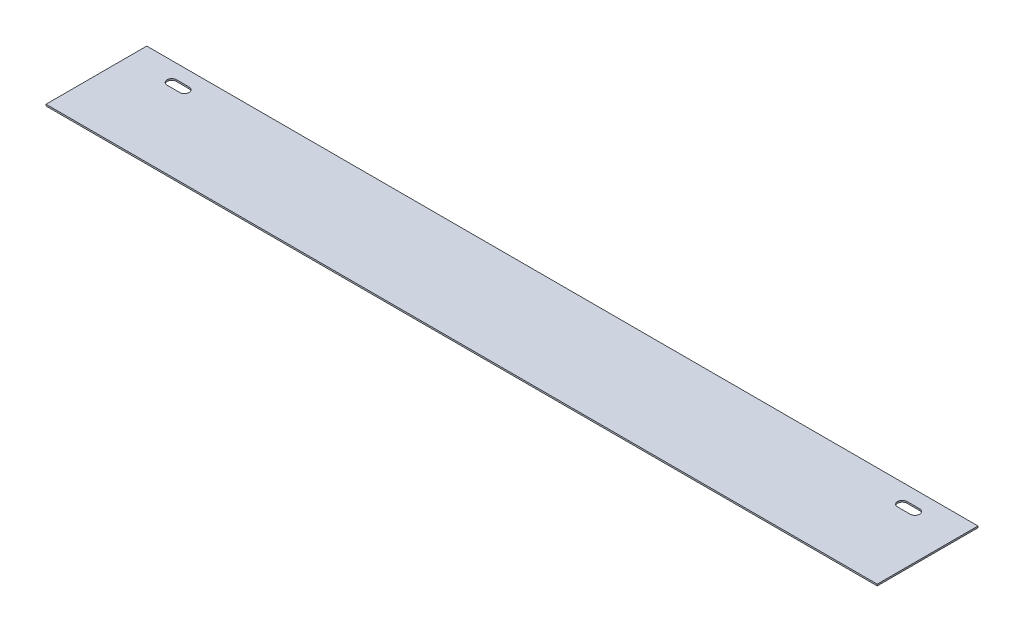
ISO-10303-21;
HEADER;
FILE_DESCRIPTION(('STEP AP214'),'2;1');
FILE_NAME('part.step','',(''),(''),'','','');
FILE_SCHEMA(('AUTOMOTIVE_DESIGN { 1 0 10303 214 1 1 1 1 }'));
ENDSEC;
DATA;
#1=APPLICATION_CONTEXT('core data for automotive mechanical design processes');
#2=APPLICATION_PROTOCOL_DEFINITION('international standard','automotive_design',2000,#1);
#3=PRODUCT_CONTEXT('',#1,'mechanical');
#4=PRODUCT('Part','Part','',(#3));
#5=PRODUCT_RELATED_PRODUCT_CATEGORY('part','',(#4));
#6=PRODUCT_DEFINITION_FORMATION('','',#4);
#7=PRODUCT_DEFINITION_CONTEXT('part definition',#1,'design');
#8=PRODUCT_DEFINITION('design','',#6,#7);
#9=PRODUCT_DEFINITION_SHAPE('','',#8);
#10=(LENGTH_UNIT() NAMED_UNIT(*) SI_UNIT(.MILLI.,.METRE.));
#11=(NAMED_UNIT(*) PLANE_ANGLE_UNIT() SI_UNIT($,.RADIAN.));
#12=(NAMED_UNIT(*) SI_UNIT($,.STERADIAN.) SOLID_ANGLE_UNIT());
#13=UNCERTAINTY_MEASURE_WITH_UNIT(LENGTH_MEASURE(1.E-05),#10,'distance_accuracy_value','');
#14=(GEOMETRIC_REPRESENTATION_CONTEXT(3) GLOBAL_UNCERTAINTY_ASSIGNED_CONTEXT((#13)) GLOBAL_UNIT_ASSIGNED_CONTEXT((#10,
#11,#12)) REPRESENTATION_CONTEXT('',''));
#15=CARTESIAN_POINT('',(0.,0.,0.));
#16=DIRECTION('',(0.,0.,1.));
#17=DIRECTION('',(1.,0.,0.));
#18=AXIS2_PLACEMENT_3D('',#15,#16,#17);
#19=CARTESIAN_POINT('',(0.,1.6002,0.));
#20=DIRECTION('',(1.,0.,0.));
#21=DIRECTION('',(0.,0.,-1.));
#22=AXIS2_PLACEMENT_3D('',#19,#20,#21);
#23=PLANE('',#22);
#24=DIRECTION('',(0.,0.,1.));
#25=VECTOR('',#24,1.);
#26=CARTESIAN_POINT('',(0.,0.,0.));
#27=LINE('',#26,#25);
#28=CARTESIAN_POINT('',(0.,0.,0.));
#29=VERTEX_POINT('',#28);
#30=CARTESIAN_POINT('',(0.,0.,101.6));
#31=VERTEX_POINT('',#30);
#32=EDGE_CURVE('E185',#29,#31,#27,.T.);
#33=ORIENTED_EDGE('',*,*,#32,.T.);
#34=DIRECTION('',(0.,-1.,0.));
#35=VECTOR('',#34,1.);
#36=CARTESIAN_POINT('',(0.,1.6002,101.6));
#37=LINE('',#36,#35);
#38=CARTESIAN_POINT('',(0.,1.6002,101.6));
#39=VERTEX_POINT('',#38);
#40=EDGE_CURVE('E11',#39,#31,#37,.T.);
#41=ORIENTED_EDGE('',*,*,#40,.F.);
#42=DIRECTION('',(0.,0.,1.));
#43=VECTOR('',#42,1.);
#44=CARTESIAN_POINT('',(0.,1.6002,0.));
#45=LINE('',#44,#43);
#46=CARTESIAN_POINT('',(0.,1.6002,0.));
#47=VERTEX_POINT('',#46);
#48=EDGE_CURVE('E192',#47,#39,#45,.T.);
#49=ORIENTED_EDGE('',*,*,#48,.F.);
#50=DIRECTION('',(0.,-1.,0.));
#51=VECTOR('',#50,1.);
#52=CARTESIAN_POINT('',(0.,1.6002,0.));
#53=LINE('',#52,#51);
#54=EDGE_CURVE('E202',#47,#29,#53,.T.);
#55=ORIENTED_EDGE('',*,*,#54,.T.);
#56=EDGE_LOOP('',(#33,#41,#49,#55));
#57=FACE_BOUND('',#56,.T.);
#58=ADVANCED_FACE('F35',(#57),#23,.F.);
#59=CARTESIAN_POINT('',(0.,1.6002,101.6));
#60=DIRECTION('',(0.,0.,-1.));
#61=DIRECTION('',(-1.,0.,0.));
#62=AXIS2_PLACEMENT_3D('',#59,#60,#61);
#63=PLANE('',#62);
#64=DIRECTION('',(1.,0.,0.));
#65=VECTOR('',#64,1.);
#66=CARTESIAN_POINT('',(0.,0.,101.6));
#67=LINE('',#66,#65);
#68=CARTESIAN_POINT('',(838.2,0.,101.6));
#69=VERTEX_POINT('',#68);
#70=EDGE_CURVE('E205',#31,#69,#67,.T.);
#71=ORIENTED_EDGE('',*,*,#70,.T.);
#72=DIRECTION('',(0.,-1.,0.));
#73=VECTOR('',#72,1.);
#74=CARTESIAN_POINT('',(838.2,1.6002,101.6));
#75=LINE('',#74,#73);
#76=CARTESIAN_POINT('',(838.2,1.6002,101.6));
#77=VERTEX_POINT('',#76);
#78=EDGE_CURVE('E42',#77,#69,#75,.T.);
#79=ORIENTED_EDGE('',*,*,#78,.F.);
#80=DIRECTION('',(1.,0.,0.));
#81=VECTOR('',#80,1.);
#82=CARTESIAN_POINT('',(0.,1.6002,101.6));
#83=LINE('',#82,#81);
#84=EDGE_CURVE('E195',#39,#77,#83,.T.);
#85=ORIENTED_EDGE('',*,*,#84,.F.);
#86=ORIENTED_EDGE('',*,*,#40,.T.);
#87=EDGE_LOOP('',(#71,#79,#85,#86));
#88=FACE_BOUND('',#87,.T.);
#89=ADVANCED_FACE('F234',(#88),#63,.F.);
#90=CARTESIAN_POINT('',(838.2,1.6002,0.));
#91=DIRECTION('',(-1.,0.,0.));
#92=DIRECTION('',(0.,0.,1.));
#93=AXIS2_PLACEMENT_3D('',#90,#91,#92);
#94=PLANE('',#93);
#95=DIRECTION('',(0.,0.,-1.));
#96=VECTOR('',#95,1.);
#97=CARTESIAN_POINT('',(838.2,0.,0.));
#98=LINE('',#97,#96);
#99=CARTESIAN_POINT('',(838.2,0.,0.));
#100=VERTEX_POINT('',#99);
#101=EDGE_CURVE('E207',#69,#100,#98,.T.);
#102=ORIENTED_EDGE('',*,*,#101,.T.);
#103=DIRECTION('',(0.,-1.,0.));
#104=VECTOR('',#103,1.);
#105=CARTESIAN_POINT('',(838.2,1.6002,0.));
#106=LINE('',#105,#104);
#107=CARTESIAN_POINT('',(838.2,1.6002,0.));
#108=VERTEX_POINT('',#107);
#109=EDGE_CURVE('E212',#108,#100,#106,.T.);
#110=ORIENTED_EDGE('',*,*,#109,.F.);
#111=DIRECTION('',(0.,0.,-1.));
#112=VECTOR('',#111,1.);
#113=CARTESIAN_POINT('',(838.2,1.6002,0.));
#114=LINE('',#113,#112);
#115=EDGE_CURVE('E198',#77,#108,#114,.T.);
#116=ORIENTED_EDGE('',*,*,#115,.F.);
#117=ORIENTED_EDGE('',*,*,#78,.T.);
#118=EDGE_LOOP('',(#102,#110,#116,#117));
#119=FACE_BOUND('',#118,.T.);
#120=ADVANCED_FACE('F219',(#119),#94,.F.);
#121=CARTESIAN_POINT('',(0.,1.6002,0.));
#122=DIRECTION('',(0.,0.,1.));
#123=DIRECTION('',(1.,0.,0.));
#124=AXIS2_PLACEMENT_3D('',#121,#122,#123);
#125=PLANE('',#124);
#126=DIRECTION('',(-1.,0.,0.));
#127=VECTOR('',#126,1.);
#128=CARTESIAN_POINT('',(0.,0.,0.));
#129=LINE('',#128,#127);
#130=EDGE_CURVE('E196',#100,#29,#129,.T.);
#131=ORIENTED_EDGE('',*,*,#130,.T.);
#132=ORIENTED_EDGE('',*,*,#54,.F.);
#133=DIRECTION('',(-1.,0.,0.));
#134=VECTOR('',#133,1.);
#135=CARTESIAN_POINT('',(0.,1.6002,0.));
#136=LINE('',#135,#134);
#137=EDGE_CURVE('E200',#108,#47,#136,.T.);
#138=ORIENTED_EDGE('',*,*,#137,.F.);
#139=ORIENTED_EDGE('',*,*,#109,.T.);
#140=EDGE_LOOP('',(#131,#132,#138,#139));
#141=FACE_BOUND('',#140,.T.);
#142=ADVANCED_FACE('F227',(#141),#125,.F.);
#143=CARTESIAN_POINT('',(0.,1.6002,0.));
#144=DIRECTION('',(0.,1.,0.));
#145=DIRECTION('',(0.,0.,1.));
#146=AXIS2_PLACEMENT_3D('',#143,#144,#145);
#147=PLANE('',#146);
#148=CARTESIAN_POINT('',(781.05,1.6002,19.177));
#149=DIRECTION('',(0.,1.,0.));
#150=DIRECTION('',(0.,0.,1.));
#151=AXIS2_PLACEMENT_3D('',#148,#149,#150);
#152=CIRCLE('',#151,4.7625);
#153=CARTESIAN_POINT('',(781.05,1.6002,14.4145));
#154=VERTEX_POINT('',#153);
#155=CARTESIAN_POINT('',(781.05,1.6002,23.9395));
#156=VERTEX_POINT('',#155);
#157=EDGE_CURVE('E49',#154,#156,#152,.T.);
#158=ORIENTED_EDGE('',*,*,#157,.F.);
#159=DIRECTION('',(-1.,0.,0.));
#160=VECTOR('',#159,1.);
#161=CARTESIAN_POINT('',(781.05,1.6002,14.4145));
#162=LINE('',#161,#160);
#163=CARTESIAN_POINT('',(793.75,1.6002,14.4145));
#164=VERTEX_POINT('',#163);
#165=EDGE_CURVE('E141',#164,#154,#162,.T.);
#166=ORIENTED_EDGE('',*,*,#165,.F.);
#167=CARTESIAN_POINT('',(793.75,1.6002,19.177));
#168=DIRECTION('',(0.,1.,0.));
#169=DIRECTION('',(0.,0.,1.));
#170=AXIS2_PLACEMENT_3D('',#167,#168,#169);
#171=CIRCLE('',#170,4.7625);
#172=CARTESIAN_POINT('',(793.75,1.6002,23.9395));
#173=VERTEX_POINT('',#172);
#174=EDGE_CURVE('E144',#173,#164,#171,.T.);
#175=ORIENTED_EDGE('',*,*,#174,.F.);
#176=DIRECTION('',(1.,0.,0.));
#177=VECTOR('',#176,1.);
#178=CARTESIAN_POINT('',(781.05,1.6002,23.9395));
#179=LINE('',#178,#177);
#180=EDGE_CURVE('E150',#156,#173,#179,.T.);
#181=ORIENTED_EDGE('',*,*,#180,.F.);
#182=EDGE_LOOP('',(#158,#166,#175,#181));
#183=FACE_BOUND('',#182,.T.);
#184=CARTESIAN_POINT('',(44.45,1.6002,19.177));
#185=DIRECTION('',(0.,1.,0.));
#186=DIRECTION('',(0.,0.,1.));
#187=AXIS2_PLACEMENT_3D('',#184,#185,#186);
#188=CIRCLE('',#187,4.7625);
#189=CARTESIAN_POINT('',(44.45,1.6002,14.4145));
#190=VERTEX_POINT('',#189);
#191=CARTESIAN_POINT('',(44.45,1.6002,23.9395));
#192=VERTEX_POINT('',#191);
#193=EDGE_CURVE('E156',#190,#192,#188,.T.);
#194=ORIENTED_EDGE('',*,*,#193,.F.);
#195=DIRECTION('',(-1.,0.,0.));
#196=VECTOR('',#195,1.);
#197=CARTESIAN_POINT('',(44.45,1.6002,14.4145));
#198=LINE('',#197,#196);
#199=CARTESIAN_POINT('',(57.15,1.6002,14.4145));
#200=VERTEX_POINT('',#199);
#201=EDGE_CURVE('E164',#200,#190,#198,.T.);
#202=ORIENTED_EDGE('',*,*,#201,.F.);
#203=CARTESIAN_POINT('',(57.15,1.6002,19.177));
#204=DIRECTION('',(0.,1.,0.));
#205=DIRECTION('',(0.,0.,1.));
#206=AXIS2_PLACEMENT_3D('',#203,#204,#205);
#207=CIRCLE('',#206,4.7625);
#208=CARTESIAN_POINT('',(57.15,1.6002,23.9395));
#209=VERTEX_POINT('',#208);
#210=EDGE_CURVE('E178',#209,#200,#207,.T.);
#211=ORIENTED_EDGE('',*,*,#210,.F.);
#212=DIRECTION('',(1.,0.,0.));
#213=VECTOR('',#212,1.);
#214=CARTESIAN_POINT('',(44.45,1.6002,23.9395));
#215=LINE('',#214,#213);
#216=EDGE_CURVE('E175',#192,#209,#215,.T.);
#217=ORIENTED_EDGE('',*,*,#216,.F.);
#218=EDGE_LOOP('',(#194,#202,#211,#217));
#219=FACE_BOUND('',#218,.T.);
#220=ORIENTED_EDGE('',*,*,#48,.T.);
#221=ORIENTED_EDGE('',*,*,#84,.T.);
#222=ORIENTED_EDGE('',*,*,#115,.T.);
#223=ORIENTED_EDGE('',*,*,#137,.T.);
#224=EDGE_LOOP('',(#220,#221,#222,#223));
#225=FACE_BOUND('',#224,.T.);
#226=ADVANCED_FACE('F233',(#183,#219,#225),#147,.T.);
#227=CARTESIAN_POINT('',(0.,0.,0.));
#228=DIRECTION('',(0.,1.,0.));
#229=DIRECTION('',(0.,0.,1.));
#230=AXIS2_PLACEMENT_3D('',#227,#228,#229);
#231=PLANE('',#230);
#232=DIRECTION('',(-1.,0.,0.));
#233=VECTOR('',#232,1.);
#234=CARTESIAN_POINT('',(781.05,0.,14.4145));
#235=LINE('',#234,#233);
#236=CARTESIAN_POINT('',(793.75,0.,14.4145));
#237=VERTEX_POINT('',#236);
#238=CARTESIAN_POINT('',(781.05,0.,14.4145));
#239=VERTEX_POINT('',#238);
#240=EDGE_CURVE('E131',#237,#239,#235,.T.);
#241=ORIENTED_EDGE('',*,*,#240,.T.);
#242=CARTESIAN_POINT('',(781.05,0.,19.177));
#243=DIRECTION('',(0.,1.,0.));
#244=DIRECTION('',(0.,0.,1.));
#245=AXIS2_PLACEMENT_3D('',#242,#243,#244);
#246=CIRCLE('',#245,4.7625);
#247=CARTESIAN_POINT('',(781.05,0.,23.9395));
#248=VERTEX_POINT('',#247);
#249=EDGE_CURVE('E125',#239,#248,#246,.T.);
#250=ORIENTED_EDGE('',*,*,#249,.T.);
#251=DIRECTION('',(1.,0.,0.));
#252=VECTOR('',#251,1.);
#253=CARTESIAN_POINT('',(781.05,0.,23.9395));
#254=LINE('',#253,#252);
#255=CARTESIAN_POINT('',(793.75,0.,23.9395));
#256=VERTEX_POINT('',#255);
#257=EDGE_CURVE('E134',#248,#256,#254,.T.);
#258=ORIENTED_EDGE('',*,*,#257,.T.);
#259=CARTESIAN_POINT('',(793.75,0.,19.177));
#260=DIRECTION('',(0.,1.,0.));
#261=DIRECTION('',(0.,0.,1.));
#262=AXIS2_PLACEMENT_3D('',#259,#260,#261);
#263=CIRCLE('',#262,4.7625);
#264=EDGE_CURVE('E57',#256,#237,#263,.T.);
#265=ORIENTED_EDGE('',*,*,#264,.T.);
#266=EDGE_LOOP('',(#241,#250,#258,#265));
#267=FACE_BOUND('',#266,.T.);
#268=DIRECTION('',(-1.,0.,0.));
#269=VECTOR('',#268,1.);
#270=CARTESIAN_POINT('',(44.45,0.,14.4145));
#271=LINE('',#270,#269);
#272=CARTESIAN_POINT('',(57.15,0.,14.4145));
#273=VERTEX_POINT('',#272);
#274=CARTESIAN_POINT('',(44.45,0.,14.4145));
#275=VERTEX_POINT('',#274);
#276=EDGE_CURVE('E170',#273,#275,#271,.T.);
#277=ORIENTED_EDGE('',*,*,#276,.T.);
#278=CARTESIAN_POINT('',(44.45,0.,19.177));
#279=DIRECTION('',(0.,1.,0.));
#280=DIRECTION('',(0.,0.,1.));
#281=AXIS2_PLACEMENT_3D('',#278,#279,#280);
#282=CIRCLE('',#281,4.7625);
#283=CARTESIAN_POINT('',(44.45,0.,23.9395));
#284=VERTEX_POINT('',#283);
#285=EDGE_CURVE('E160',#275,#284,#282,.T.);
#286=ORIENTED_EDGE('',*,*,#285,.T.);
#287=DIRECTION('',(1.,0.,0.));
#288=VECTOR('',#287,1.);
#289=CARTESIAN_POINT('',(44.45,0.,23.9395));
#290=LINE('',#289,#288);
#291=CARTESIAN_POINT('',(57.15,0.,23.9395));
#292=VERTEX_POINT('',#291);
#293=EDGE_CURVE('E163',#284,#292,#290,.T.);
#294=ORIENTED_EDGE('',*,*,#293,.T.);
#295=CARTESIAN_POINT('',(57.15,0.,19.177));
#296=DIRECTION('',(0.,1.,0.));
#297=DIRECTION('',(0.,0.,1.));
#298=AXIS2_PLACEMENT_3D('',#295,#296,#297);
#299=CIRCLE('',#298,4.7625);
#300=EDGE_CURVE('E167',#292,#273,#299,.T.);
#301=ORIENTED_EDGE('',*,*,#300,.T.);
#302=EDGE_LOOP('',(#277,#286,#294,#301));
#303=FACE_BOUND('',#302,.T.);
#304=ORIENTED_EDGE('',*,*,#32,.F.);
#305=ORIENTED_EDGE('',*,*,#130,.F.);
#306=ORIENTED_EDGE('',*,*,#101,.F.);
#307=ORIENTED_EDGE('',*,*,#70,.F.);
#308=EDGE_LOOP('',(#304,#305,#306,#307));
#309=FACE_BOUND('',#308,.T.);
#310=ADVANCED_FACE('F138',(#267,#303,#309),#231,.F.);
#311=CARTESIAN_POINT('',(44.45,0.,19.177));
#312=DIRECTION('',(0.,1.,0.));
#313=DIRECTION('',(0.,0.,1.));
#314=AXIS2_PLACEMENT_3D('',#311,#312,#313);
#315=CYLINDRICAL_SURFACE('',#314,4.7625);
#316=ORIENTED_EDGE('',*,*,#193,.T.);
#317=DIRECTION('',(0.,1.,0.));
#318=VECTOR('',#317,1.);
#319=CARTESIAN_POINT('',(44.45,0.,23.9395));
#320=LINE('',#319,#318);
#321=EDGE_CURVE('E173',#284,#192,#320,.T.);
#322=ORIENTED_EDGE('',*,*,#321,.F.);
#323=ORIENTED_EDGE('',*,*,#285,.F.);
#324=DIRECTION('',(0.,1.,0.));
#325=VECTOR('',#324,1.);
#326=CARTESIAN_POINT('',(44.45,0.,14.4145));
#327=LINE('',#326,#325);
#328=EDGE_CURVE('E183',#275,#190,#327,.T.);
#329=ORIENTED_EDGE('',*,*,#328,.T.);
#330=EDGE_LOOP('',(#316,#322,#323,#329));
#331=FACE_BOUND('',#330,.T.);
#332=ADVANCED_FACE('F246',(#331),#315,.F.);
#333=CARTESIAN_POINT('',(44.45,0.,14.4145));
#334=DIRECTION('',(0.,0.,-1.));
#335=DIRECTION('',(-1.,0.,0.));
#336=AXIS2_PLACEMENT_3D('',#333,#334,#335);
#337=PLANE('',#336);
#338=ORIENTED_EDGE('',*,*,#201,.T.);
#339=ORIENTED_EDGE('',*,*,#328,.F.);
#340=ORIENTED_EDGE('',*,*,#276,.F.);
#341=DIRECTION('',(0.,1.,0.));
#342=VECTOR('',#341,1.);
#343=CARTESIAN_POINT('',(57.15,0.,14.4145));
#344=LINE('',#343,#342);
#345=EDGE_CURVE('E186',#273,#200,#344,.T.);
#346=ORIENTED_EDGE('',*,*,#345,.T.);
#347=EDGE_LOOP('',(#338,#339,#340,#346));
#348=FACE_BOUND('',#347,.T.);
#349=ADVANCED_FACE('F252',(#348),#337,.F.);
#350=CARTESIAN_POINT('',(57.15,0.,19.177));
#351=DIRECTION('',(0.,1.,0.));
#352=DIRECTION('',(0.,0.,1.));
#353=AXIS2_PLACEMENT_3D('',#350,#351,#352);
#354=CYLINDRICAL_SURFACE('',#353,4.7625);
#355=ORIENTED_EDGE('',*,*,#210,.T.);
#356=ORIENTED_EDGE('',*,*,#345,.F.);
#357=ORIENTED_EDGE('',*,*,#300,.F.);
#358=DIRECTION('',(0.,1.,0.));
#359=VECTOR('',#358,1.);
#360=CARTESIAN_POINT('',(57.15,0.,23.9395));
#361=LINE('',#360,#359);
#362=EDGE_CURVE('E188',#292,#209,#361,.T.);
#363=ORIENTED_EDGE('',*,*,#362,.T.);
#364=EDGE_LOOP('',(#355,#356,#357,#363));
#365=FACE_BOUND('',#364,.T.);
#366=ADVANCED_FACE('F257',(#365),#354,.F.);
#367=CARTESIAN_POINT('',(44.45,0.,23.9395));
#368=DIRECTION('',(0.,0.,1.));
#369=DIRECTION('',(1.,0.,0.));
#370=AXIS2_PLACEMENT_3D('',#367,#368,#369);
#371=PLANE('',#370);
#372=ORIENTED_EDGE('',*,*,#216,.T.);
#373=ORIENTED_EDGE('',*,*,#362,.F.);
#374=ORIENTED_EDGE('',*,*,#293,.F.);
#375=ORIENTED_EDGE('',*,*,#321,.T.);
#376=EDGE_LOOP('',(#372,#373,#374,#375));
#377=FACE_BOUND('',#376,.T.);
#378=ADVANCED_FACE('F254',(#377),#371,.F.);
#379=CARTESIAN_POINT('',(781.05,0.,19.177));
#380=DIRECTION('',(0.,1.,0.));
#381=DIRECTION('',(0.,0.,1.));
#382=AXIS2_PLACEMENT_3D('',#379,#380,#381);
#383=CYLINDRICAL_SURFACE('',#382,4.7625);
#384=ORIENTED_EDGE('',*,*,#157,.T.);
#385=DIRECTION('',(0.,1.,0.));
#386=VECTOR('',#385,1.);
#387=CARTESIAN_POINT('',(781.05,0.,23.9395));
#388=LINE('',#387,#386);
#389=EDGE_CURVE('E121',#248,#156,#388,.T.);
#390=ORIENTED_EDGE('',*,*,#389,.F.);
#391=ORIENTED_EDGE('',*,*,#249,.F.);
#392=DIRECTION('',(0.,1.,0.));
#393=VECTOR('',#392,1.);
#394=CARTESIAN_POINT('',(781.05,0.,14.4145));
#395=LINE('',#394,#393);
#396=EDGE_CURVE('E154',#239,#154,#395,.T.);
#397=ORIENTED_EDGE('',*,*,#396,.T.);
#398=EDGE_LOOP('',(#384,#390,#391,#397));
#399=FACE_BOUND('',#398,.T.);
#400=ADVANCED_FACE('F123',(#399),#383,.F.);
#401=CARTESIAN_POINT('',(781.05,0.,14.4145));
#402=DIRECTION('',(0.,0.,-1.));
#403=DIRECTION('',(-1.,0.,0.));
#404=AXIS2_PLACEMENT_3D('',#401,#402,#403);
#405=PLANE('',#404);
#406=ORIENTED_EDGE('',*,*,#165,.T.);
#407=ORIENTED_EDGE('',*,*,#396,.F.);
#408=ORIENTED_EDGE('',*,*,#240,.F.);
#409=DIRECTION('',(0.,1.,0.));
#410=VECTOR('',#409,1.);
#411=CARTESIAN_POINT('',(793.75,0.,14.4145));
#412=LINE('',#411,#410);
#413=EDGE_CURVE('E157',#237,#164,#412,.T.);
#414=ORIENTED_EDGE('',*,*,#413,.T.);
#415=EDGE_LOOP('',(#406,#407,#408,#414));
#416=FACE_BOUND('',#415,.T.);
#417=ADVANCED_FACE('F267',(#416),#405,.F.);
#418=CARTESIAN_POINT('',(793.75,0.,19.177));
#419=DIRECTION('',(0.,1.,0.));
#420=DIRECTION('',(0.,0.,1.));
#421=AXIS2_PLACEMENT_3D('',#418,#419,#420);
#422=CYLINDRICAL_SURFACE('',#421,4.7625);
#423=ORIENTED_EDGE('',*,*,#174,.T.);
#424=ORIENTED_EDGE('',*,*,#413,.F.);
#425=ORIENTED_EDGE('',*,*,#264,.F.);
#426=DIRECTION('',(0.,1.,0.));
#427=VECTOR('',#426,1.);
#428=CARTESIAN_POINT('',(793.75,0.,23.9395));
#429=LINE('',#428,#427);
#430=EDGE_CURVE('E130',#256,#173,#429,.T.);
#431=ORIENTED_EDGE('',*,*,#430,.T.);
#432=EDGE_LOOP('',(#423,#424,#425,#431));
#433=FACE_BOUND('',#432,.T.);
#434=ADVANCED_FACE('F270',(#433),#422,.F.);
#435=CARTESIAN_POINT('',(781.05,0.,23.9395));
#436=DIRECTION('',(0.,0.,1.));
#437=DIRECTION('',(1.,0.,0.));
#438=AXIS2_PLACEMENT_3D('',#435,#436,#437);
#439=PLANE('',#438);
#440=ORIENTED_EDGE('',*,*,#180,.T.);
#441=ORIENTED_EDGE('',*,*,#430,.F.);
#442=ORIENTED_EDGE('',*,*,#257,.F.);
#443=ORIENTED_EDGE('',*,*,#389,.T.);
#444=EDGE_LOOP('',(#440,#441,#442,#443));
#445=FACE_BOUND('',#444,.T.);
#446=ADVANCED_FACE('F135',(#445),#439,.F.);
#447=CLOSED_SHELL('',(#58,#89,#120,#142,#226,#310,#332,#349,#366,#378,#400,#417,#434,#446));
#448=MANIFOLD_SOLID_BREP('B2',#447);
#449=ADVANCED_BREP_SHAPE_REPRESENTATION('',(#18,#448),#14);
#450=SHAPE_DEFINITION_REPRESENTATION(#9,#449);
ENDSEC;
END-ISO-10303-21;
